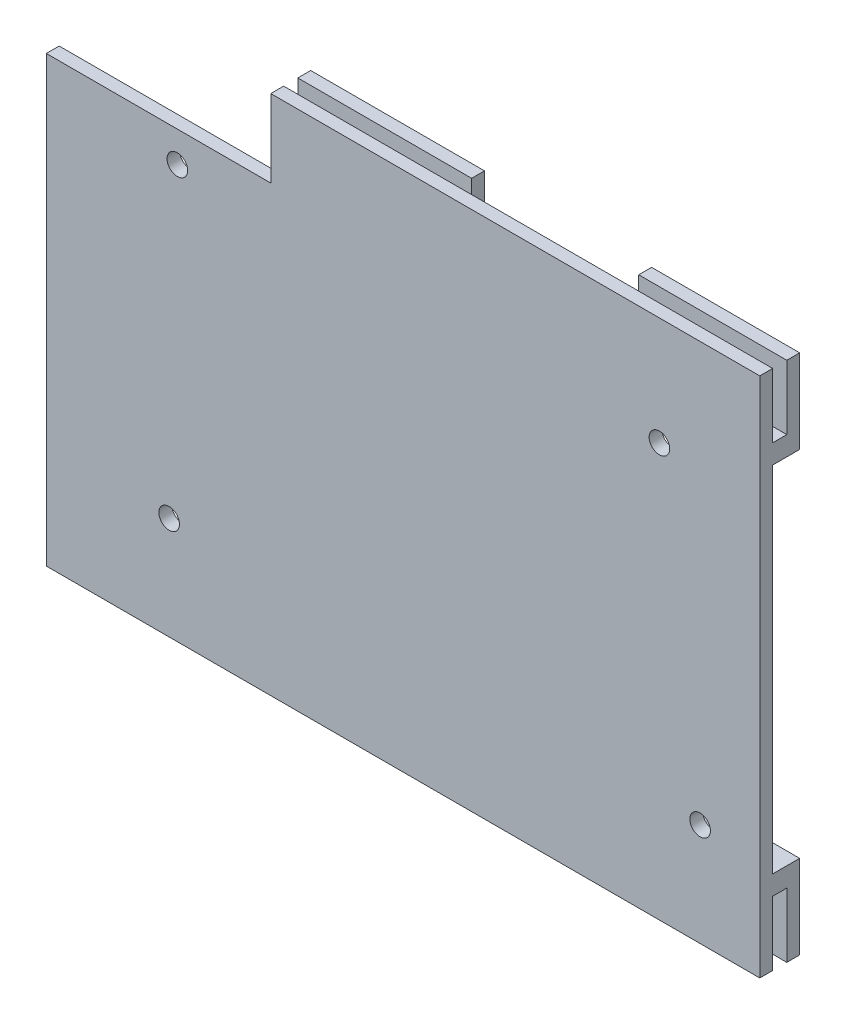
ISO-10303-21;
HEADER;
FILE_DESCRIPTION(('STEP AP214'),'2;1');
FILE_NAME('part.step','',(''),(''),'','','');
FILE_SCHEMA(('AUTOMOTIVE_DESIGN { 1 0 10303 214 1 1 1 1 }'));
ENDSEC;
DATA;
#1=APPLICATION_CONTEXT('core data for automotive mechanical design processes');
#2=APPLICATION_PROTOCOL_DEFINITION('international standard','automotive_design',2000,#1);
#3=PRODUCT_CONTEXT('',#1,'mechanical');
#4=PRODUCT('Part','Part','',(#3));
#5=PRODUCT_RELATED_PRODUCT_CATEGORY('part','',(#4));
#6=PRODUCT_DEFINITION_FORMATION('','',#4);
#7=PRODUCT_DEFINITION_CONTEXT('part definition',#1,'design');
#8=PRODUCT_DEFINITION('design','',#6,#7);
#9=PRODUCT_DEFINITION_SHAPE('','',#8);
#10=(LENGTH_UNIT() NAMED_UNIT(*) SI_UNIT(.MILLI.,.METRE.));
#11=(NAMED_UNIT(*) PLANE_ANGLE_UNIT() SI_UNIT($,.RADIAN.));
#12=(NAMED_UNIT(*) SI_UNIT($,.STERADIAN.) SOLID_ANGLE_UNIT());
#13=UNCERTAINTY_MEASURE_WITH_UNIT(LENGTH_MEASURE(1.E-05),#10,'distance_accuracy_value','');
#14=(GEOMETRIC_REPRESENTATION_CONTEXT(3) GLOBAL_UNCERTAINTY_ASSIGNED_CONTEXT((#13)) GLOBAL_UNIT_ASSIGNED_CONTEXT((#10,
#11,#12)) REPRESENTATION_CONTEXT('',''));
#15=CARTESIAN_POINT('',(0.,0.,0.));
#16=DIRECTION('',(0.,0.,1.));
#17=DIRECTION('',(1.,0.,0.));
#18=AXIS2_PLACEMENT_3D('',#15,#16,#17);
#19=CARTESIAN_POINT('',(55.,28.,-2.2));
#20=DIRECTION('',(0.,1.,0.));
#21=DIRECTION('',(0.,0.,1.));
#22=AXIS2_PLACEMENT_3D('',#19,#20,#21);
#23=PLANE('',#22);
#24=DIRECTION('',(-1.,0.,0.));
#25=VECTOR('',#24,1.);
#26=CARTESIAN_POINT('',(55.,28.,0.));
#27=LINE('',#26,#25);
#28=CARTESIAN_POINT('',(55.,28.,0.));
#29=VERTEX_POINT('',#28);
#30=CARTESIAN_POINT('',(32.,28.,0.));
#31=VERTEX_POINT('',#30);
#32=EDGE_CURVE('E304',#29,#31,#27,.T.);
#33=ORIENTED_EDGE('',*,*,#32,.T.);
#34=DIRECTION('',(0.,0.,-1.));
#35=VECTOR('',#34,1.);
#36=CARTESIAN_POINT('',(32.,28.,-2.2));
#37=LINE('',#36,#35);
#38=CARTESIAN_POINT('',(32.,28.,-4.2));
#39=VERTEX_POINT('',#38);
#40=EDGE_CURVE('E433',#31,#39,#37,.T.);
#41=ORIENTED_EDGE('',*,*,#40,.T.);
#42=DIRECTION('',(-1.,0.,0.));
#43=VECTOR('',#42,1.);
#44=CARTESIAN_POINT('',(55.,28.,-4.2));
#45=LINE('',#44,#43);
#46=CARTESIAN_POINT('',(55.,28.,-4.2));
#47=VERTEX_POINT('',#46);
#48=EDGE_CURVE('E364',#47,#39,#45,.T.);
#49=ORIENTED_EDGE('',*,*,#48,.F.);
#50=DIRECTION('',(0.,0.,1.));
#51=VECTOR('',#50,1.);
#52=CARTESIAN_POINT('',(55.,28.,-2.2));
#53=LINE('',#52,#51);
#54=EDGE_CURVE('E606',#47,#29,#53,.T.);
#55=ORIENTED_EDGE('',*,*,#54,.T.);
#56=EDGE_LOOP('',(#33,#41,#49,#55));
#57=FACE_BOUND('',#56,.T.);
#58=ADVANCED_FACE('F44',(#57),#23,.F.);
#59=CARTESIAN_POINT('',(55.,31.,-2.2));
#60=DIRECTION('',(0.,-1.,0.));
#61=DIRECTION('',(0.,0.,-1.));
#62=AXIS2_PLACEMENT_3D('',#59,#60,#61);
#63=PLANE('',#62);
#64=DIRECTION('',(1.,0.,0.));
#65=VECTOR('',#64,1.);
#66=CARTESIAN_POINT('',(55.,31.,-2.2));
#67=LINE('',#66,#65);
#68=CARTESIAN_POINT('',(32.,31.,-2.2));
#69=VERTEX_POINT('',#68);
#70=CARTESIAN_POINT('',(55.,31.,-2.2));
#71=VERTEX_POINT('',#70);
#72=EDGE_CURVE('E303',#69,#71,#67,.T.);
#73=ORIENTED_EDGE('',*,*,#72,.F.);
#74=DIRECTION('',(0.,0.,1.));
#75=VECTOR('',#74,1.);
#76=CARTESIAN_POINT('',(32.,31.,-2.2));
#77=LINE('',#76,#75);
#78=CARTESIAN_POINT('',(32.,31.,0.));
#79=VERTEX_POINT('',#78);
#80=EDGE_CURVE('E440',#69,#79,#77,.T.);
#81=ORIENTED_EDGE('',*,*,#80,.T.);
#82=DIRECTION('',(1.,0.,0.));
#83=VECTOR('',#82,1.);
#84=CARTESIAN_POINT('',(55.,31.,0.));
#85=LINE('',#84,#83);
#86=CARTESIAN_POINT('',(55.,31.,0.));
#87=VERTEX_POINT('',#86);
#88=EDGE_CURVE('E273',#79,#87,#85,.T.);
#89=ORIENTED_EDGE('',*,*,#88,.T.);
#90=DIRECTION('',(0.,0.,1.));
#91=VECTOR('',#90,1.);
#92=CARTESIAN_POINT('',(55.,31.,-2.2));
#93=LINE('',#92,#91);
#94=EDGE_CURVE('E322',#71,#87,#93,.T.);
#95=ORIENTED_EDGE('',*,*,#94,.F.);
#96=EDGE_LOOP('',(#73,#81,#89,#95));
#97=FACE_BOUND('',#96,.T.);
#98=ADVANCED_FACE('F613',(#97),#63,.F.);
#99=CARTESIAN_POINT('',(55.,-27.,-2.2));
#100=DIRECTION('',(0.,-1.,0.));
#101=DIRECTION('',(0.,0.,-1.));
#102=AXIS2_PLACEMENT_3D('',#99,#100,#101);
#103=PLANE('',#102);
#104=DIRECTION('',(1.,0.,0.));
#105=VECTOR('',#104,1.);
#106=CARTESIAN_POINT('',(55.,-27.,-4.2));
#107=LINE('',#106,#105);
#108=CARTESIAN_POINT('',(32.,-27.,-4.2));
#109=VERTEX_POINT('',#108);
#110=CARTESIAN_POINT('',(55.,-27.,-4.2));
#111=VERTEX_POINT('',#110);
#112=EDGE_CURVE('E377',#109,#111,#107,.T.);
#113=ORIENTED_EDGE('',*,*,#112,.F.);
#114=DIRECTION('',(0.,0.,1.));
#115=VECTOR('',#114,1.);
#116=CARTESIAN_POINT('',(32.,-27.,-2.2));
#117=LINE('',#116,#115);
#118=CARTESIAN_POINT('',(32.,-27.,0.));
#119=VERTEX_POINT('',#118);
#120=EDGE_CURVE('E436',#109,#119,#117,.T.);
#121=ORIENTED_EDGE('',*,*,#120,.T.);
#122=DIRECTION('',(1.,0.,0.));
#123=VECTOR('',#122,1.);
#124=CARTESIAN_POINT('',(55.,-27.,0.));
#125=LINE('',#124,#123);
#126=CARTESIAN_POINT('',(55.,-27.,0.));
#127=VERTEX_POINT('',#126);
#128=EDGE_CURVE('E332',#119,#127,#125,.T.);
#129=ORIENTED_EDGE('',*,*,#128,.T.);
#130=DIRECTION('',(0.,0.,1.));
#131=VECTOR('',#130,1.);
#132=CARTESIAN_POINT('',(55.,-27.,-2.2));
#133=LINE('',#132,#131);
#134=EDGE_CURVE('E340',#111,#127,#133,.T.);
#135=ORIENTED_EDGE('',*,*,#134,.F.);
#136=EDGE_LOOP('',(#113,#121,#129,#135));
#137=FACE_BOUND('',#136,.T.);
#138=ADVANCED_FACE('F524',(#137),#103,.F.);
#139=CARTESIAN_POINT('',(55.,-30.,-2.2));
#140=DIRECTION('',(0.,1.,0.));
#141=DIRECTION('',(0.,0.,1.));
#142=AXIS2_PLACEMENT_3D('',#139,#140,#141);
#143=PLANE('',#142);
#144=DIRECTION('',(-1.,0.,0.));
#145=VECTOR('',#144,1.);
#146=CARTESIAN_POINT('',(55.,-30.,0.));
#147=LINE('',#146,#145);
#148=CARTESIAN_POINT('',(55.,-30.,0.));
#149=VERTEX_POINT('',#148);
#150=CARTESIAN_POINT('',(32.,-30.,0.));
#151=VERTEX_POINT('',#150);
#152=EDGE_CURVE('E333',#149,#151,#147,.T.);
#153=ORIENTED_EDGE('',*,*,#152,.T.);
#154=DIRECTION('',(0.,0.,-1.));
#155=VECTOR('',#154,1.);
#156=CARTESIAN_POINT('',(32.,-30.,-2.2));
#157=LINE('',#156,#155);
#158=CARTESIAN_POINT('',(32.,-30.,-2.2));
#159=VERTEX_POINT('',#158);
#160=EDGE_CURVE('E447',#151,#159,#157,.T.);
#161=ORIENTED_EDGE('',*,*,#160,.T.);
#162=DIRECTION('',(-1.,0.,0.));
#163=VECTOR('',#162,1.);
#164=CARTESIAN_POINT('',(55.,-30.,-2.2));
#165=LINE('',#164,#163);
#166=CARTESIAN_POINT('',(55.,-30.,-2.2));
#167=VERTEX_POINT('',#166);
#168=EDGE_CURVE('E323',#167,#159,#165,.T.);
#169=ORIENTED_EDGE('',*,*,#168,.F.);
#170=DIRECTION('',(0.,0.,1.));
#171=VECTOR('',#170,1.);
#172=CARTESIAN_POINT('',(55.,-30.,-2.2));
#173=LINE('',#172,#171);
#174=EDGE_CURVE('E337',#167,#149,#173,.T.);
#175=ORIENTED_EDGE('',*,*,#174,.T.);
#176=EDGE_LOOP('',(#153,#161,#169,#175));
#177=FACE_BOUND('',#176,.T.);
#178=ADVANCED_FACE('F636',(#177),#143,.F.);
#179=CARTESIAN_POINT('',(0.,0.,-2.2));
#180=DIRECTION('',(0.,0.,1.));
#181=DIRECTION('',(1.,0.,0.));
#182=AXIS2_PLACEMENT_3D('',#179,#180,#181);
#183=PLANE('',#182);
#184=DIRECTION('',(0.,1.,0.));
#185=VECTOR('',#184,1.);
#186=CARTESIAN_POINT('',(32.,0.,-2.2));
#187=LINE('',#186,#185);
#188=CARTESIAN_POINT('',(32.,41.,-2.19999999999999));
#189=VERTEX_POINT('',#188);
#190=EDGE_CURVE('E444',#69,#189,#187,.T.);
#191=ORIENTED_EDGE('',*,*,#190,.F.);
#192=ORIENTED_EDGE('',*,*,#72,.T.);
#193=DIRECTION('',(0.,-1.,0.));
#194=VECTOR('',#193,1.);
#195=CARTESIAN_POINT('',(55.,28.,-2.2));
#196=LINE('',#195,#194);
#197=CARTESIAN_POINT('',(55.,41.,-2.2));
#198=VERTEX_POINT('',#197);
#199=EDGE_CURVE('E355',#198,#71,#196,.T.);
#200=ORIENTED_EDGE('',*,*,#199,.F.);
#201=DIRECTION('',(1.,0.,0.));
#202=VECTOR('',#201,1.);
#203=CARTESIAN_POINT('',(55.,41.,-2.2));
#204=LINE('',#203,#202);
#205=EDGE_CURVE('E354',#189,#198,#204,.T.);
#206=ORIENTED_EDGE('',*,*,#205,.F.);
#207=EDGE_LOOP('',(#191,#192,#200,#206));
#208=FACE_BOUND('',#207,.T.);
#209=ADVANCED_FACE('F721',(#208),#183,.T.);
#210=CARTESIAN_POINT('',(55.,41.,-4.2));
#211=DIRECTION('',(0.,-1.,0.));
#212=DIRECTION('',(0.,0.,-1.));
#213=AXIS2_PLACEMENT_3D('',#210,#211,#212);
#214=PLANE('',#213);
#215=DIRECTION('',(1.,0.,0.));
#216=VECTOR('',#215,1.);
#217=CARTESIAN_POINT('',(55.,41.,-4.2));
#218=LINE('',#217,#216);
#219=CARTESIAN_POINT('',(32.,41.,-4.2));
#220=VERTEX_POINT('',#219);
#221=CARTESIAN_POINT('',(55.,41.,-4.2));
#222=VERTEX_POINT('',#221);
#223=EDGE_CURVE('E363',#220,#222,#218,.T.);
#224=ORIENTED_EDGE('',*,*,#223,.F.);
#225=DIRECTION('',(0.,0.,-1.));
#226=VECTOR('',#225,1.);
#227=CARTESIAN_POINT('',(32.,41.,85.0583423304264));
#228=LINE('',#227,#226);
#229=EDGE_CURVE('E486',#189,#220,#228,.T.);
#230=ORIENTED_EDGE('',*,*,#229,.F.);
#231=ORIENTED_EDGE('',*,*,#205,.T.);
#232=DIRECTION('',(0.,0.,1.));
#233=VECTOR('',#232,1.);
#234=CARTESIAN_POINT('',(55.,41.,-4.2));
#235=LINE('',#234,#233);
#236=EDGE_CURVE('E344',#222,#198,#235,.T.);
#237=ORIENTED_EDGE('',*,*,#236,.F.);
#238=EDGE_LOOP('',(#224,#230,#231,#237));
#239=FACE_BOUND('',#238,.T.);
#240=ADVANCED_FACE('F733',(#239),#214,.F.);
#241=CARTESIAN_POINT('',(0.,0.,-4.2));
#242=DIRECTION('',(0.,0.,1.));
#243=DIRECTION('',(1.,0.,0.));
#244=AXIS2_PLACEMENT_3D('',#241,#242,#243);
#245=PLANE('',#244);
#246=ORIENTED_EDGE('',*,*,#48,.T.);
#247=DIRECTION('',(0.,-1.,0.));
#248=VECTOR('',#247,1.);
#249=CARTESIAN_POINT('',(32.,41.,-4.2));
#250=LINE('',#249,#248);
#251=EDGE_CURVE('E253',#220,#39,#250,.T.);
#252=ORIENTED_EDGE('',*,*,#251,.F.);
#253=ORIENTED_EDGE('',*,*,#223,.T.);
#254=DIRECTION('',(0.,-1.,0.));
#255=VECTOR('',#254,1.);
#256=CARTESIAN_POINT('',(55.,28.,-4.2));
#257=LINE('',#256,#255);
#258=EDGE_CURVE('E353',#222,#47,#257,.T.);
#259=ORIENTED_EDGE('',*,*,#258,.T.);
#260=EDGE_LOOP('',(#246,#252,#253,#259));
#261=FACE_BOUND('',#260,.T.);
#262=ADVANCED_FACE('F744',(#261),#245,.F.);
#263=CARTESIAN_POINT('',(0.,0.,-2.2));
#264=DIRECTION('',(0.,0.,1.));
#265=DIRECTION('',(1.,0.,0.));
#266=AXIS2_PLACEMENT_3D('',#263,#264,#265);
#267=PLANE('',#266);
#268=DIRECTION('',(0.,1.,0.));
#269=VECTOR('',#268,1.);
#270=CARTESIAN_POINT('',(32.,0.,-2.2));
#271=LINE('',#270,#269);
#272=CARTESIAN_POINT('',(32.,-40.,-2.19999999999999));
#273=VERTEX_POINT('',#272);
#274=EDGE_CURVE('E451',#273,#159,#271,.T.);
#275=ORIENTED_EDGE('',*,*,#274,.F.);
#276=DIRECTION('',(-1.,0.,0.));
#277=VECTOR('',#276,1.);
#278=CARTESIAN_POINT('',(55.,-40.,-2.2));
#279=LINE('',#278,#277);
#280=CARTESIAN_POINT('',(55.,-40.,-2.2));
#281=VERTEX_POINT('',#280);
#282=EDGE_CURVE('E387',#281,#273,#279,.T.);
#283=ORIENTED_EDGE('',*,*,#282,.F.);
#284=DIRECTION('',(0.,-1.,0.));
#285=VECTOR('',#284,1.);
#286=CARTESIAN_POINT('',(55.,-27.,-2.2));
#287=LINE('',#286,#285);
#288=EDGE_CURVE('E359',#167,#281,#287,.T.);
#289=ORIENTED_EDGE('',*,*,#288,.F.);
#290=ORIENTED_EDGE('',*,*,#168,.T.);
#291=EDGE_LOOP('',(#275,#283,#289,#290));
#292=FACE_BOUND('',#291,.T.);
#293=ADVANCED_FACE('F640',(#292),#267,.T.);
#294=CARTESIAN_POINT('',(55.,-40.,-4.2));
#295=DIRECTION('',(0.,1.,0.));
#296=DIRECTION('',(0.,0.,1.));
#297=AXIS2_PLACEMENT_3D('',#294,#295,#296);
#298=PLANE('',#297);
#299=ORIENTED_EDGE('',*,*,#282,.T.);
#300=DIRECTION('',(0.,0.,-1.));
#301=VECTOR('',#300,1.);
#302=CARTESIAN_POINT('',(32.,-40.,85.0583423304264));
#303=LINE('',#302,#301);
#304=CARTESIAN_POINT('',(32.,-40.,-4.2));
#305=VERTEX_POINT('',#304);
#306=EDGE_CURVE('E474',#273,#305,#303,.T.);
#307=ORIENTED_EDGE('',*,*,#306,.T.);
#308=DIRECTION('',(-1.,0.,0.));
#309=VECTOR('',#308,1.);
#310=CARTESIAN_POINT('',(55.,-40.,-4.2));
#311=LINE('',#310,#309);
#312=CARTESIAN_POINT('',(55.,-40.,-4.2));
#313=VERTEX_POINT('',#312);
#314=EDGE_CURVE('E381',#313,#305,#311,.T.);
#315=ORIENTED_EDGE('',*,*,#314,.F.);
#316=DIRECTION('',(0.,0.,1.));
#317=VECTOR('',#316,1.);
#318=CARTESIAN_POINT('',(55.,-40.,-4.2));
#319=LINE('',#318,#317);
#320=EDGE_CURVE('E391',#313,#281,#319,.T.);
#321=ORIENTED_EDGE('',*,*,#320,.T.);
#322=EDGE_LOOP('',(#299,#307,#315,#321));
#323=FACE_BOUND('',#322,.T.);
#324=ADVANCED_FACE('F642',(#323),#298,.F.);
#325=CARTESIAN_POINT('',(0.,0.,-4.2));
#326=DIRECTION('',(0.,0.,1.));
#327=DIRECTION('',(1.,0.,0.));
#328=AXIS2_PLACEMENT_3D('',#325,#326,#327);
#329=PLANE('',#328);
#330=ORIENTED_EDGE('',*,*,#314,.T.);
#331=DIRECTION('',(0.,1.,0.));
#332=VECTOR('',#331,1.);
#333=CARTESIAN_POINT('',(32.,0.,-4.2));
#334=LINE('',#333,#332);
#335=EDGE_CURVE('E53',#305,#109,#334,.T.);
#336=ORIENTED_EDGE('',*,*,#335,.T.);
#337=ORIENTED_EDGE('',*,*,#112,.T.);
#338=DIRECTION('',(0.,-1.,0.));
#339=VECTOR('',#338,1.);
#340=CARTESIAN_POINT('',(55.,-27.,-4.2));
#341=LINE('',#340,#339);
#342=EDGE_CURVE('E378',#111,#313,#341,.T.);
#343=ORIENTED_EDGE('',*,*,#342,.T.);
#344=EDGE_LOOP('',(#330,#336,#337,#343));
#345=FACE_BOUND('',#344,.T.);
#346=ADVANCED_FACE('F644',(#345),#329,.F.);
#347=CARTESIAN_POINT('',(6.04,28.,-4.2));
#348=VERTEX_POINT('',#347);
#349=CARTESIAN_POINT('',(-20.96,28.,-4.2));
#350=VERTEX_POINT('',#349);
#351=EDGE_CURVE('E368',#348,#350,#45,.T.);
#352=ORIENTED_EDGE('',*,*,#351,.F.);
#353=DIRECTION('',(0.,0.,1.));
#354=VECTOR('',#353,1.);
#355=CARTESIAN_POINT('',(6.04,28.,-2.2));
#356=LINE('',#355,#354);
#357=CARTESIAN_POINT('',(6.03999999999999,28.,0.));
#358=VERTEX_POINT('',#357);
#359=EDGE_CURVE('E67',#348,#358,#356,.T.);
#360=ORIENTED_EDGE('',*,*,#359,.T.);
#361=CARTESIAN_POINT('',(-20.96,28.,0.));
#362=VERTEX_POINT('',#361);
#363=EDGE_CURVE('E312',#358,#362,#27,.T.);
#364=ORIENTED_EDGE('',*,*,#363,.T.);
#365=DIRECTION('',(0.,0.,-1.));
#366=VECTOR('',#365,1.);
#367=CARTESIAN_POINT('',(-20.96,28.,-2.2));
#368=LINE('',#367,#366);
#369=EDGE_CURVE('E395',#362,#350,#368,.T.);
#370=ORIENTED_EDGE('',*,*,#369,.T.);
#371=EDGE_LOOP('',(#352,#360,#364,#370));
#372=FACE_BOUND('',#371,.T.);
#373=ADVANCED_FACE('F646',(#372),#23,.F.);
#374=CARTESIAN_POINT('',(-20.9574410194763,31.,0.));
#375=VERTEX_POINT('',#374);
#376=CARTESIAN_POINT('',(6.03999999999999,31.,0.));
#377=VERTEX_POINT('',#376);
#378=EDGE_CURVE('E288',#375,#377,#85,.T.);
#379=ORIENTED_EDGE('',*,*,#378,.T.);
#380=DIRECTION('',(0.,0.,-1.));
#381=VECTOR('',#380,1.);
#382=CARTESIAN_POINT('',(6.03999999999999,31.,-2.2));
#383=LINE('',#382,#381);
#384=CARTESIAN_POINT('',(6.03999999999999,31.,-2.2));
#385=VERTEX_POINT('',#384);
#386=EDGE_CURVE('E460',#377,#385,#383,.T.);
#387=ORIENTED_EDGE('',*,*,#386,.T.);
#388=CARTESIAN_POINT('',(-20.96,31.,-2.2));
#389=VERTEX_POINT('',#388);
#390=EDGE_CURVE('E309',#389,#385,#67,.T.);
#391=ORIENTED_EDGE('',*,*,#390,.F.);
#392=DIRECTION('',(0.,0.,-1.));
#393=VECTOR('',#392,1.);
#394=CARTESIAN_POINT('',(-20.96,31.,-2.2));
#395=LINE('',#394,#393);
#396=CARTESIAN_POINT('',(-20.96,31.,0.));
#397=VERTEX_POINT('',#396);
#398=EDGE_CURVE('E420',#397,#389,#395,.T.);
#399=ORIENTED_EDGE('',*,*,#398,.F.);
#400=EDGE_CURVE('E295',#397,#375,#85,.T.);
#401=ORIENTED_EDGE('',*,*,#400,.T.);
#402=EDGE_LOOP('',(#379,#387,#391,#399,#401));
#403=FACE_BOUND('',#402,.T.);
#404=ADVANCED_FACE('F653',(#403),#63,.F.);
#405=CARTESIAN_POINT('',(0.,0.,0.));
#406=DIRECTION('',(0.,0.,1.));
#407=DIRECTION('',(1.,0.,0.));
#408=AXIS2_PLACEMENT_3D('',#405,#406,#407);
#409=PLANE('',#408);
#410=ORIENTED_EDGE('',*,*,#400,.F.);
#411=DIRECTION('',(0.,-1.,0.));
#412=VECTOR('',#411,1.);
#413=CARTESIAN_POINT('',(-20.96,41.,0.));
#414=LINE('',#413,#412);
#415=CARTESIAN_POINT('',(-20.96,28.963654442647,0.));
#416=VERTEX_POINT('',#415);
#417=EDGE_CURVE('E427',#397,#416,#414,.T.);
#418=ORIENTED_EDGE('',*,*,#417,.T.);
#419=DIRECTION('',(1.,0.,0.));
#420=VECTOR('',#419,1.);
#421=CARTESIAN_POINT('',(-55.,28.963654442647,0.));
#422=LINE('',#421,#420);
#423=CARTESIAN_POINT('',(-20.9574410194763,28.963654442647,0.));
#424=VERTEX_POINT('',#423);
#425=EDGE_CURVE('E582',#416,#424,#422,.T.);
#426=ORIENTED_EDGE('',*,*,#425,.T.);
#427=DIRECTION('',(0.,1.,0.));
#428=VECTOR('',#427,1.);
#429=CARTESIAN_POINT('',(-20.9574410194763,40.,0.));
#430=LINE('',#429,#428);
#431=EDGE_CURVE('E578',#424,#375,#430,.T.);
#432=ORIENTED_EDGE('',*,*,#431,.T.);
#433=EDGE_LOOP('',(#410,#418,#426,#432));
#434=FACE_BOUND('',#433,.T.);
#435=ADVANCED_FACE('F1030',(#434),#409,.T.);
#436=CARTESIAN_POINT('',(-20.96,-27.,0.));
#437=VERTEX_POINT('',#436);
#438=CARTESIAN_POINT('',(6.03999999999999,-27.,0.));
#439=VERTEX_POINT('',#438);
#440=EDGE_CURVE('E318',#437,#439,#125,.T.);
#441=ORIENTED_EDGE('',*,*,#440,.T.);
#442=DIRECTION('',(0.,0.,-1.));
#443=VECTOR('',#442,1.);
#444=CARTESIAN_POINT('',(6.04,-27.,-2.2));
#445=LINE('',#444,#443);
#446=CARTESIAN_POINT('',(6.03999999999999,-27.,-4.2));
#447=VERTEX_POINT('',#446);
#448=EDGE_CURVE('E456',#439,#447,#445,.T.);
#449=ORIENTED_EDGE('',*,*,#448,.T.);
#450=CARTESIAN_POINT('',(-20.96,-27.,-4.2));
#451=VERTEX_POINT('',#450);
#452=EDGE_CURVE('E372',#451,#447,#107,.T.);
#453=ORIENTED_EDGE('',*,*,#452,.F.);
#454=DIRECTION('',(0.,0.,1.));
#455=VECTOR('',#454,1.);
#456=CARTESIAN_POINT('',(-20.96,-27.,-2.2));
#457=LINE('',#456,#455);
#458=EDGE_CURVE('E399',#451,#437,#457,.T.);
#459=ORIENTED_EDGE('',*,*,#458,.T.);
#460=EDGE_LOOP('',(#441,#449,#453,#459));
#461=FACE_BOUND('',#460,.T.);
#462=ADVANCED_FACE('F844',(#461),#103,.F.);
#463=CARTESIAN_POINT('',(6.03999999999999,-30.,-2.2));
#464=VERTEX_POINT('',#463);
#465=CARTESIAN_POINT('',(-20.96,-30.,-2.2));
#466=VERTEX_POINT('',#465);
#467=EDGE_CURVE('E328',#464,#466,#165,.T.);
#468=ORIENTED_EDGE('',*,*,#467,.F.);
#469=DIRECTION('',(0.,0.,1.));
#470=VECTOR('',#469,1.);
#471=CARTESIAN_POINT('',(6.03999999999999,-30.,-2.2));
#472=LINE('',#471,#470);
#473=CARTESIAN_POINT('',(6.03999999999999,-30.,0.));
#474=VERTEX_POINT('',#473);
#475=EDGE_CURVE('E466',#464,#474,#472,.T.);
#476=ORIENTED_EDGE('',*,*,#475,.T.);
#477=CARTESIAN_POINT('',(-20.96,-30.,0.));
#478=VERTEX_POINT('',#477);
#479=EDGE_CURVE('E327',#474,#478,#147,.T.);
#480=ORIENTED_EDGE('',*,*,#479,.T.);
#481=DIRECTION('',(0.,0.,1.));
#482=VECTOR('',#481,1.);
#483=CARTESIAN_POINT('',(-20.96,-30.,-2.2));
#484=LINE('',#483,#482);
#485=EDGE_CURVE('E423',#466,#478,#484,.T.);
#486=ORIENTED_EDGE('',*,*,#485,.F.);
#487=EDGE_LOOP('',(#468,#476,#480,#486));
#488=FACE_BOUND('',#487,.T.);
#489=ADVANCED_FACE('F698',(#488),#143,.F.);
#490=CARTESIAN_POINT('',(0.,0.,0.));
#491=DIRECTION('',(0.,0.,-1.));
#492=DIRECTION('',(-1.,0.,0.));
#493=AXIS2_PLACEMENT_3D('',#490,#491,#492);
#494=PLANE('',#493);
#495=DIRECTION('',(0.,-1.,0.));
#496=VECTOR('',#495,1.);
#497=CARTESIAN_POINT('',(-55.8235429728034,97.9273088852941,0.));
#498=LINE('',#497,#496);
#499=CARTESIAN_POINT('',(-55.8235429728034,28.963654442647,0.));
#500=VERTEX_POINT('',#499);
#501=CARTESIAN_POINT('',(-55.8235429728034,-40.,0.));
#502=VERTEX_POINT('',#501);
#503=EDGE_CURVE('E248',#500,#502,#498,.T.);
#504=ORIENTED_EDGE('',*,*,#503,.F.);
#505=EDGE_CURVE('E590',#500,#416,#422,.T.);
#506=ORIENTED_EDGE('',*,*,#505,.T.);
#507=EDGE_CURVE('E432',#416,#362,#414,.T.);
#508=ORIENTED_EDGE('',*,*,#507,.T.);
#509=ORIENTED_EDGE('',*,*,#363,.F.);
#510=DIRECTION('',(0.,-1.,0.));
#511=VECTOR('',#510,1.);
#512=CARTESIAN_POINT('',(6.03999999999999,41.,0.));
#513=LINE('',#512,#511);
#514=EDGE_CURVE('E498',#377,#358,#513,.T.);
#515=ORIENTED_EDGE('',*,*,#514,.F.);
#516=ORIENTED_EDGE('',*,*,#378,.F.);
#517=CARTESIAN_POINT('',(-20.9574410194763,41.,0.));
#518=VERTEX_POINT('',#517);
#519=EDGE_CURVE('E589',#375,#518,#430,.T.);
#520=ORIENTED_EDGE('',*,*,#519,.T.);
#521=DIRECTION('',(-1.,0.,0.));
#522=VECTOR('',#521,1.);
#523=CARTESIAN_POINT('',(-20.9574410194763,41.,0.));
#524=LINE('',#523,#522);
#525=CARTESIAN_POINT('',(55.,41.,0.));
#526=VERTEX_POINT('',#525);
#527=EDGE_CURVE('E585',#526,#518,#524,.T.);
#528=ORIENTED_EDGE('',*,*,#527,.F.);
#529=DIRECTION('',(0.,1.,0.));
#530=VECTOR('',#529,1.);
#531=CARTESIAN_POINT('',(55.,-40.,0.));
#532=LINE('',#531,#530);
#533=EDGE_CURVE('E284',#87,#526,#532,.T.);
#534=ORIENTED_EDGE('',*,*,#533,.F.);
#535=ORIENTED_EDGE('',*,*,#88,.F.);
#536=DIRECTION('',(0.,1.,0.));
#537=VECTOR('',#536,1.);
#538=CARTESIAN_POINT('',(32.,41.,0.));
#539=LINE('',#538,#537);
#540=EDGE_CURVE('E495',#31,#79,#539,.T.);
#541=ORIENTED_EDGE('',*,*,#540,.F.);
#542=ORIENTED_EDGE('',*,*,#32,.F.);
#543=EDGE_CURVE('E283',#127,#29,#532,.T.);
#544=ORIENTED_EDGE('',*,*,#543,.F.);
#545=ORIENTED_EDGE('',*,*,#128,.F.);
#546=EDGE_CURVE('E473',#151,#119,#539,.T.);
#547=ORIENTED_EDGE('',*,*,#546,.F.);
#548=ORIENTED_EDGE('',*,*,#152,.F.);
#549=CARTESIAN_POINT('',(55.,-40.,0.));
#550=VERTEX_POINT('',#549);
#551=EDGE_CURVE('E279',#550,#149,#532,.T.);
#552=ORIENTED_EDGE('',*,*,#551,.F.);
#553=DIRECTION('',(1.,0.,0.));
#554=VECTOR('',#553,1.);
#555=CARTESIAN_POINT('',(-55.,-40.,0.));
#556=LINE('',#555,#554);
#557=EDGE_CURVE('E275',#502,#550,#556,.T.);
#558=ORIENTED_EDGE('',*,*,#557,.F.);
#559=EDGE_LOOP('',(#504,#506,#508,#509,#515,#516,#520,#528,#534,#535,#541,#542,#544,#545,#547,
#548,#552,#558));
#560=FACE_BOUND('',#559,.T.);
#561=ORIENTED_EDGE('',*,*,#479,.F.);
#562=EDGE_CURVE('E489',#439,#474,#513,.T.);
#563=ORIENTED_EDGE('',*,*,#562,.F.);
#564=ORIENTED_EDGE('',*,*,#440,.F.);
#565=EDGE_CURVE('E428',#437,#478,#414,.T.);
#566=ORIENTED_EDGE('',*,*,#565,.T.);
#567=EDGE_LOOP('',(#561,#563,#564,#566));
#568=FACE_BOUND('',#567,.T.);
#569=CARTESIAN_POINT('',(-36.7409523113356,-24.0404431673531,0.));
#570=DIRECTION('',(0.,0.,-1.));
#571=DIRECTION('',(-1.,0.,0.));
#572=AXIS2_PLACEMENT_3D('',#569,#570,#571);
#573=CIRCLE('',#572,1.6);
#574=CARTESIAN_POINT('',(-38.3409523113356,-24.0404431673531,0.));
#575=VERTEX_POINT('',#574);
#576=EDGE_CURVE('E555',#575,#575,#573,.T.);
#577=ORIENTED_EDGE('',*,*,#576,.F.);
#578=EDGE_LOOP('',(#577));
#579=FACE_BOUND('',#578,.T.);
#580=CARTESIAN_POINT('',(-35.4709523113356,24.1815568326469,0.));
#581=DIRECTION('',(0.,0.,-1.));
#582=DIRECTION('',(-1.,0.,0.));
#583=AXIS2_PLACEMENT_3D('',#580,#581,#582);
#584=CIRCLE('',#583,1.6);
#585=CARTESIAN_POINT('',(-37.0709523113356,24.1815568326469,0.));
#586=VERTEX_POINT('',#585);
#587=EDGE_CURVE('E543',#586,#586,#584,.T.);
#588=ORIENTED_EDGE('',*,*,#587,.F.);
#589=EDGE_LOOP('',(#588));
#590=FACE_BOUND('',#589,.T.);
#591=CARTESIAN_POINT('',(45.7380476886644,-24.0404431673531,0.));
#592=DIRECTION('',(0.,0.,-1.));
#593=DIRECTION('',(-1.,0.,0.));
#594=AXIS2_PLACEMENT_3D('',#591,#592,#593);
#595=CIRCLE('',#594,1.6);
#596=CARTESIAN_POINT('',(44.1380476886644,-24.0404431673531,0.));
#597=VERTEX_POINT('',#596);
#598=EDGE_CURVE('E564',#597,#597,#595,.T.);
#599=ORIENTED_EDGE('',*,*,#598,.F.);
#600=EDGE_LOOP('',(#599));
#601=FACE_BOUND('',#600,.T.);
#602=CARTESIAN_POINT('',(39.4110476886644,24.1815568326469,0.));
#603=DIRECTION('',(0.,0.,-1.));
#604=DIRECTION('',(-1.,0.,0.));
#605=AXIS2_PLACEMENT_3D('',#602,#603,#604);
#606=CIRCLE('',#605,1.6);
#607=CARTESIAN_POINT('',(37.8110476886644,24.1815568326469,0.));
#608=VERTEX_POINT('',#607);
#609=EDGE_CURVE('E549',#608,#608,#606,.T.);
#610=ORIENTED_EDGE('',*,*,#609,.F.);
#611=EDGE_LOOP('',(#610));
#612=FACE_BOUND('',#611,.T.);
#613=ADVANCED_FACE('F531',(#560,#568,#579,#590,#601,#612),#494,.T.);
#614=CARTESIAN_POINT('',(55.,-40.,2.));
#615=DIRECTION('',(-1.,0.,0.));
#616=DIRECTION('',(0.,0.,1.));
#617=AXIS2_PLACEMENT_3D('',#614,#615,#616);
#618=PLANE('',#617);
#619=ORIENTED_EDGE('',*,*,#551,.T.);
#620=ORIENTED_EDGE('',*,*,#174,.F.);
#621=ORIENTED_EDGE('',*,*,#288,.T.);
#622=ORIENTED_EDGE('',*,*,#320,.F.);
#623=ORIENTED_EDGE('',*,*,#342,.F.);
#624=ORIENTED_EDGE('',*,*,#134,.T.);
#625=ORIENTED_EDGE('',*,*,#543,.T.);
#626=ORIENTED_EDGE('',*,*,#54,.F.);
#627=ORIENTED_EDGE('',*,*,#258,.F.);
#628=ORIENTED_EDGE('',*,*,#236,.T.);
#629=ORIENTED_EDGE('',*,*,#199,.T.);
#630=ORIENTED_EDGE('',*,*,#94,.T.);
#631=ORIENTED_EDGE('',*,*,#533,.T.);
#632=DIRECTION('',(0.,0.,-1.));
#633=VECTOR('',#632,1.);
#634=CARTESIAN_POINT('',(55.,41.,2.));
#635=LINE('',#634,#633);
#636=CARTESIAN_POINT('',(55.,41.,2.));
#637=VERTEX_POINT('',#636);
#638=EDGE_CURVE('E595',#637,#526,#635,.T.);
#639=ORIENTED_EDGE('',*,*,#638,.F.);
#640=DIRECTION('',(0.,1.,0.));
#641=VECTOR('',#640,1.);
#642=CARTESIAN_POINT('',(55.,-40.,2.));
#643=LINE('',#642,#641);
#644=CARTESIAN_POINT('',(55.,-40.,2.));
#645=VERTEX_POINT('',#644);
#646=EDGE_CURVE('E269',#645,#637,#643,.T.);
#647=ORIENTED_EDGE('',*,*,#646,.F.);
#648=DIRECTION('',(0.,0.,-1.));
#649=VECTOR('',#648,1.);
#650=CARTESIAN_POINT('',(55.,-40.,2.));
#651=LINE('',#650,#649);
#652=EDGE_CURVE('E266',#645,#550,#651,.T.);
#653=ORIENTED_EDGE('',*,*,#652,.T.);
#654=EDGE_LOOP('',(#619,#620,#621,#622,#623,#624,#625,#626,#627,#628,#629,#630,#631,#639,#647,#653));
#655=FACE_BOUND('',#654,.T.);
#656=ADVANCED_FACE('F46',(#655),#618,.F.);
#657=CARTESIAN_POINT('',(-55.,-40.,2.));
#658=DIRECTION('',(0.,1.,0.));
#659=DIRECTION('',(0.,0.,1.));
#660=AXIS2_PLACEMENT_3D('',#657,#658,#659);
#661=PLANE('',#660);
#662=DIRECTION('',(1.,0.,0.));
#663=VECTOR('',#662,1.);
#664=CARTESIAN_POINT('',(-55.,-40.,2.));
#665=LINE('',#664,#663);
#666=CARTESIAN_POINT('',(-55.8235429728034,-40.,2.));
#667=VERTEX_POINT('',#666);
#668=EDGE_CURVE('E258',#667,#645,#665,.T.);
#669=ORIENTED_EDGE('',*,*,#668,.F.);
#670=DIRECTION('',(0.,0.,-1.));
#671=VECTOR('',#670,1.);
#672=CARTESIAN_POINT('',(-55.8235429728034,-40.,2.));
#673=LINE('',#672,#671);
#674=EDGE_CURVE('E245',#667,#502,#673,.T.);
#675=ORIENTED_EDGE('',*,*,#674,.T.);
#676=ORIENTED_EDGE('',*,*,#557,.T.);
#677=ORIENTED_EDGE('',*,*,#652,.F.);
#678=EDGE_LOOP('',(#669,#675,#676,#677));
#679=FACE_BOUND('',#678,.T.);
#680=ADVANCED_FACE('F264',(#679),#661,.F.);
#681=CARTESIAN_POINT('',(0.,0.,2.));
#682=DIRECTION('',(0.,0.,-1.));
#683=DIRECTION('',(-1.,0.,0.));
#684=AXIS2_PLACEMENT_3D('',#681,#682,#683);
#685=PLANE('',#684);
#686=CARTESIAN_POINT('',(-36.7409523113356,-24.0404431673531,2.));
#687=DIRECTION('',(0.,0.,-1.));
#688=DIRECTION('',(-1.,0.,0.));
#689=AXIS2_PLACEMENT_3D('',#686,#687,#688);
#690=CIRCLE('',#689,1.6);
#691=CARTESIAN_POINT('',(-38.3409523113356,-24.0404431673531,2.));
#692=VERTEX_POINT('',#691);
#693=EDGE_CURVE('E551',#692,#692,#690,.T.);
#694=ORIENTED_EDGE('',*,*,#693,.T.);
#695=EDGE_LOOP('',(#694));
#696=FACE_BOUND('',#695,.T.);
#697=CARTESIAN_POINT('',(45.7380476886644,-24.0404431673531,2.));
#698=DIRECTION('',(0.,0.,-1.));
#699=DIRECTION('',(-1.,0.,0.));
#700=AXIS2_PLACEMENT_3D('',#697,#698,#699);
#701=CIRCLE('',#700,1.6);
#702=CARTESIAN_POINT('',(44.1380476886644,-24.0404431673531,2.));
#703=VERTEX_POINT('',#702);
#704=EDGE_CURVE('E560',#703,#703,#701,.T.);
#705=ORIENTED_EDGE('',*,*,#704,.T.);
#706=EDGE_LOOP('',(#705));
#707=FACE_BOUND('',#706,.T.);
#708=CARTESIAN_POINT('',(39.4110476886644,24.1815568326469,2.));
#709=DIRECTION('',(0.,0.,-1.));
#710=DIRECTION('',(-1.,0.,0.));
#711=AXIS2_PLACEMENT_3D('',#708,#709,#710);
#712=CIRCLE('',#711,1.6);
#713=CARTESIAN_POINT('',(37.8110476886644,24.1815568326469,2.));
#714=VERTEX_POINT('',#713);
#715=EDGE_CURVE('E568',#714,#714,#712,.T.);
#716=ORIENTED_EDGE('',*,*,#715,.T.);
#717=EDGE_LOOP('',(#716));
#718=FACE_BOUND('',#717,.T.);
#719=CARTESIAN_POINT('',(-35.4709523113356,24.1815568326469,2.));
#720=DIRECTION('',(0.,0.,-1.));
#721=DIRECTION('',(-1.,0.,0.));
#722=AXIS2_PLACEMENT_3D('',#719,#720,#721);
#723=CIRCLE('',#722,1.6);
#724=CARTESIAN_POINT('',(-37.0709523113356,24.1815568326469,2.));
#725=VERTEX_POINT('',#724);
#726=EDGE_CURVE('E536',#725,#725,#723,.T.);
#727=ORIENTED_EDGE('',*,*,#726,.T.);
#728=EDGE_LOOP('',(#727));
#729=FACE_BOUND('',#728,.T.);
#730=DIRECTION('',(1.,0.,0.));
#731=VECTOR('',#730,1.);
#732=CARTESIAN_POINT('',(-55.,28.963654442647,2.));
#733=LINE('',#732,#731);
#734=CARTESIAN_POINT('',(-55.8235429728034,28.963654442647,2.));
#735=VERTEX_POINT('',#734);
#736=CARTESIAN_POINT('',(-20.9574410194763,28.963654442647,2.));
#737=VERTEX_POINT('',#736);
#738=EDGE_CURVE('E261',#735,#737,#733,.T.);
#739=ORIENTED_EDGE('',*,*,#738,.F.);
#740=DIRECTION('',(0.,-1.,0.));
#741=VECTOR('',#740,1.);
#742=CARTESIAN_POINT('',(-55.8235429728034,97.9273088852941,2.));
#743=LINE('',#742,#741);
#744=EDGE_CURVE('E60',#735,#667,#743,.T.);
#745=ORIENTED_EDGE('',*,*,#744,.T.);
#746=ORIENTED_EDGE('',*,*,#668,.T.);
#747=ORIENTED_EDGE('',*,*,#646,.T.);
#748=DIRECTION('',(1.,0.,0.));
#749=VECTOR('',#748,1.);
#750=CARTESIAN_POINT('',(-20.9574410194763,41.,2.));
#751=LINE('',#750,#749);
#752=CARTESIAN_POINT('',(-20.9574410194763,41.,2.));
#753=VERTEX_POINT('',#752);
#754=EDGE_CURVE('E598',#753,#637,#751,.T.);
#755=ORIENTED_EDGE('',*,*,#754,.F.);
#756=DIRECTION('',(0.,1.,0.));
#757=VECTOR('',#756,1.);
#758=CARTESIAN_POINT('',(-20.9574410194763,40.,2.));
#759=LINE('',#758,#757);
#760=EDGE_CURVE('E579',#737,#753,#759,.T.);
#761=ORIENTED_EDGE('',*,*,#760,.F.);
#762=EDGE_LOOP('',(#739,#745,#746,#747,#755,#761));
#763=FACE_BOUND('',#762,.T.);
#764=ADVANCED_FACE('F257',(#696,#707,#718,#729,#763),#685,.F.);
#765=CARTESIAN_POINT('',(-35.4709523113356,24.1815568326469,2.));
#766=DIRECTION('',(0.,0.,-1.));
#767=DIRECTION('',(-1.,0.,0.));
#768=AXIS2_PLACEMENT_3D('',#765,#766,#767);
#769=CYLINDRICAL_SURFACE('',#768,1.6);
#770=ORIENTED_EDGE('',*,*,#726,.F.);
#771=EDGE_LOOP('',(#770));
#772=FACE_BOUND('',#771,.T.);
#773=ORIENTED_EDGE('',*,*,#587,.T.);
#774=EDGE_LOOP('',(#773));
#775=FACE_BOUND('',#774,.T.);
#776=ADVANCED_FACE('F683',(#772,#775),#769,.F.);
#777=CARTESIAN_POINT('',(39.4110476886644,24.1815568326469,2.));
#778=DIRECTION('',(0.,0.,-1.));
#779=DIRECTION('',(-1.,0.,0.));
#780=AXIS2_PLACEMENT_3D('',#777,#778,#779);
#781=CYLINDRICAL_SURFACE('',#780,1.6);
#782=ORIENTED_EDGE('',*,*,#715,.F.);
#783=EDGE_LOOP('',(#782));
#784=FACE_BOUND('',#783,.T.);
#785=ORIENTED_EDGE('',*,*,#609,.T.);
#786=EDGE_LOOP('',(#785));
#787=FACE_BOUND('',#786,.T.);
#788=ADVANCED_FACE('F679',(#784,#787),#781,.F.);
#789=CARTESIAN_POINT('',(45.7380476886644,-24.0404431673531,2.));
#790=DIRECTION('',(0.,0.,-1.));
#791=DIRECTION('',(-1.,0.,0.));
#792=AXIS2_PLACEMENT_3D('',#789,#790,#791);
#793=CYLINDRICAL_SURFACE('',#792,1.6);
#794=ORIENTED_EDGE('',*,*,#704,.F.);
#795=EDGE_LOOP('',(#794));
#796=FACE_BOUND('',#795,.T.);
#797=ORIENTED_EDGE('',*,*,#598,.T.);
#798=EDGE_LOOP('',(#797));
#799=FACE_BOUND('',#798,.T.);
#800=ADVANCED_FACE('F682',(#796,#799),#793,.F.);
#801=CARTESIAN_POINT('',(-36.7409523113356,-24.0404431673531,2.));
#802=DIRECTION('',(0.,0.,-1.));
#803=DIRECTION('',(-1.,0.,0.));
#804=AXIS2_PLACEMENT_3D('',#801,#802,#803);
#805=CYLINDRICAL_SURFACE('',#804,1.6);
#806=ORIENTED_EDGE('',*,*,#693,.F.);
#807=EDGE_LOOP('',(#806));
#808=FACE_BOUND('',#807,.T.);
#809=ORIENTED_EDGE('',*,*,#576,.T.);
#810=EDGE_LOOP('',(#809));
#811=FACE_BOUND('',#810,.T.);
#812=ADVANCED_FACE('F676',(#808,#811),#805,.F.);
#813=CARTESIAN_POINT('',(-20.9574410194763,40.,0.));
#814=DIRECTION('',(1.,0.,0.));
#815=DIRECTION('',(0.,0.,-1.));
#816=AXIS2_PLACEMENT_3D('',#813,#814,#815);
#817=PLANE('',#816);
#818=ORIENTED_EDGE('',*,*,#760,.T.);
#819=DIRECTION('',(0.,0.,1.));
#820=VECTOR('',#819,1.);
#821=CARTESIAN_POINT('',(-20.9574410194763,41.,2.));
#822=LINE('',#821,#820);
#823=EDGE_CURVE('E602',#518,#753,#822,.T.);
#824=ORIENTED_EDGE('',*,*,#823,.F.);
#825=ORIENTED_EDGE('',*,*,#519,.F.);
#826=ORIENTED_EDGE('',*,*,#431,.F.);
#827=DIRECTION('',(0.,0.,1.));
#828=VECTOR('',#827,1.);
#829=CARTESIAN_POINT('',(-20.9574410194763,28.963654442647,0.));
#830=LINE('',#829,#828);
#831=EDGE_CURVE('E556',#424,#737,#830,.T.);
#832=ORIENTED_EDGE('',*,*,#831,.T.);
#833=EDGE_LOOP('',(#818,#824,#825,#826,#832));
#834=FACE_BOUND('',#833,.T.);
#835=ADVANCED_FACE('F624',(#834),#817,.F.);
#836=CARTESIAN_POINT('',(-55.,28.963654442647,0.));
#837=DIRECTION('',(0.,-1.,0.));
#838=DIRECTION('',(0.,0.,-1.));
#839=AXIS2_PLACEMENT_3D('',#836,#837,#838);
#840=PLANE('',#839);
#841=ORIENTED_EDGE('',*,*,#505,.F.);
#842=DIRECTION('',(0.,0.,1.));
#843=VECTOR('',#842,1.);
#844=CARTESIAN_POINT('',(-55.8235429728034,28.963654442647,0.));
#845=LINE('',#844,#843);
#846=EDGE_CURVE('E12',#500,#735,#845,.T.);
#847=ORIENTED_EDGE('',*,*,#846,.T.);
#848=ORIENTED_EDGE('',*,*,#738,.T.);
#849=ORIENTED_EDGE('',*,*,#831,.F.);
#850=ORIENTED_EDGE('',*,*,#425,.F.);
#851=EDGE_LOOP('',(#841,#847,#848,#849,#850));
#852=FACE_BOUND('',#851,.T.);
#853=ADVANCED_FACE('F630',(#852),#840,.F.);
#854=CARTESIAN_POINT('',(0.,41.,0.));
#855=DIRECTION('',(0.,-1.,0.));
#856=DIRECTION('',(0.,0.,-1.));
#857=AXIS2_PLACEMENT_3D('',#854,#855,#856);
#858=PLANE('',#857);
#859=ORIENTED_EDGE('',*,*,#823,.T.);
#860=ORIENTED_EDGE('',*,*,#754,.T.);
#861=ORIENTED_EDGE('',*,*,#638,.T.);
#862=ORIENTED_EDGE('',*,*,#527,.T.);
#863=EDGE_LOOP('',(#859,#860,#861,#862));
#864=FACE_BOUND('',#863,.T.);
#865=ADVANCED_FACE('F620',(#864),#858,.F.);
#866=DIRECTION('',(0.,-1.,0.));
#867=VECTOR('',#866,1.);
#868=CARTESIAN_POINT('',(6.03999999999999,0.,-2.2));
#869=LINE('',#868,#867);
#870=CARTESIAN_POINT('',(6.03999999999999,41.,-2.19999999999999));
#871=VERTEX_POINT('',#870);
#872=EDGE_CURVE('E463',#871,#385,#869,.T.);
#873=ORIENTED_EDGE('',*,*,#872,.F.);
#874=CARTESIAN_POINT('',(-20.96,41.,-2.2));
#875=VERTEX_POINT('',#874);
#876=EDGE_CURVE('E349',#875,#871,#204,.T.);
#877=ORIENTED_EDGE('',*,*,#876,.F.);
#878=DIRECTION('',(0.,1.,0.));
#879=VECTOR('',#878,1.);
#880=CARTESIAN_POINT('',(-20.96,41.,-2.2));
#881=LINE('',#880,#879);
#882=EDGE_CURVE('E416',#389,#875,#881,.T.);
#883=ORIENTED_EDGE('',*,*,#882,.F.);
#884=ORIENTED_EDGE('',*,*,#390,.T.);
#885=EDGE_LOOP('',(#873,#877,#883,#884));
#886=FACE_BOUND('',#885,.T.);
#887=ADVANCED_FACE('F673',(#886),#183,.T.);
#888=ORIENTED_EDGE('',*,*,#876,.T.);
#889=DIRECTION('',(0.,0.,-1.));
#890=VECTOR('',#889,1.);
#891=CARTESIAN_POINT('',(6.03999999999999,41.,85.0583423304264));
#892=LINE('',#891,#890);
#893=CARTESIAN_POINT('',(6.03999999999999,41.,-4.2));
#894=VERTEX_POINT('',#893);
#895=EDGE_CURVE('E482',#871,#894,#892,.T.);
#896=ORIENTED_EDGE('',*,*,#895,.T.);
#897=CARTESIAN_POINT('',(-20.96,41.,-4.2));
#898=VERTEX_POINT('',#897);
#899=EDGE_CURVE('E348',#898,#894,#218,.T.);
#900=ORIENTED_EDGE('',*,*,#899,.F.);
#901=DIRECTION('',(0.,0.,1.));
#902=VECTOR('',#901,1.);
#903=CARTESIAN_POINT('',(-20.96,41.,-4.2));
#904=LINE('',#903,#902);
#905=EDGE_CURVE('E402',#898,#875,#904,.T.);
#906=ORIENTED_EDGE('',*,*,#905,.T.);
#907=EDGE_LOOP('',(#888,#896,#900,#906));
#908=FACE_BOUND('',#907,.T.);
#909=ADVANCED_FACE('F718',(#908),#214,.F.);
#910=ORIENTED_EDGE('',*,*,#899,.T.);
#911=DIRECTION('',(0.,1.,0.));
#912=VECTOR('',#911,1.);
#913=CARTESIAN_POINT('',(6.03999999999999,41.,-4.2));
#914=LINE('',#913,#912);
#915=EDGE_CURVE('E492',#348,#894,#914,.T.);
#916=ORIENTED_EDGE('',*,*,#915,.F.);
#917=ORIENTED_EDGE('',*,*,#351,.T.);
#918=DIRECTION('',(0.,1.,0.));
#919=VECTOR('',#918,1.);
#920=CARTESIAN_POINT('',(-20.96,41.,-4.2));
#921=LINE('',#920,#919);
#922=EDGE_CURVE('E415',#350,#898,#921,.T.);
#923=ORIENTED_EDGE('',*,*,#922,.T.);
#924=EDGE_LOOP('',(#910,#916,#917,#923));
#925=FACE_BOUND('',#924,.T.);
#926=ADVANCED_FACE('F730',(#925),#245,.F.);
#927=DIRECTION('',(0.,-1.,0.));
#928=VECTOR('',#927,1.);
#929=CARTESIAN_POINT('',(6.03999999999999,0.,-2.2));
#930=LINE('',#929,#928);
#931=CARTESIAN_POINT('',(6.03999999999999,-40.,-2.19999999999999));
#932=VERTEX_POINT('',#931);
#933=EDGE_CURVE('E470',#464,#932,#930,.T.);
#934=ORIENTED_EDGE('',*,*,#933,.F.);
#935=ORIENTED_EDGE('',*,*,#467,.T.);
#936=CARTESIAN_POINT('',(-20.96,-40.,-2.2));
#937=VERTEX_POINT('',#936);
#938=EDGE_CURVE('E411',#937,#466,#881,.T.);
#939=ORIENTED_EDGE('',*,*,#938,.F.);
#940=EDGE_CURVE('E376',#932,#937,#279,.T.);
#941=ORIENTED_EDGE('',*,*,#940,.F.);
#942=EDGE_LOOP('',(#934,#935,#939,#941));
#943=FACE_BOUND('',#942,.T.);
#944=ADVANCED_FACE('F742',(#943),#267,.T.);
#945=CARTESIAN_POINT('',(6.03999999999999,-40.,-4.2));
#946=VERTEX_POINT('',#945);
#947=CARTESIAN_POINT('',(-20.96,-40.,-4.2));
#948=VERTEX_POINT('',#947);
#949=EDGE_CURVE('E384',#946,#948,#311,.T.);
#950=ORIENTED_EDGE('',*,*,#949,.F.);
#951=DIRECTION('',(0.,0.,-1.));
#952=VECTOR('',#951,1.);
#953=CARTESIAN_POINT('',(6.03999999999999,-40.,85.0583423304264));
#954=LINE('',#953,#952);
#955=EDGE_CURVE('E478',#932,#946,#954,.T.);
#956=ORIENTED_EDGE('',*,*,#955,.F.);
#957=ORIENTED_EDGE('',*,*,#940,.T.);
#958=DIRECTION('',(0.,0.,1.));
#959=VECTOR('',#958,1.);
#960=CARTESIAN_POINT('',(-20.96,-40.,-4.2));
#961=LINE('',#960,#959);
#962=EDGE_CURVE('E403',#948,#937,#961,.T.);
#963=ORIENTED_EDGE('',*,*,#962,.F.);
#964=EDGE_LOOP('',(#950,#956,#957,#963));
#965=FACE_BOUND('',#964,.T.);
#966=ADVANCED_FACE('F657',(#965),#298,.F.);
#967=ORIENTED_EDGE('',*,*,#452,.T.);
#968=EDGE_CURVE('E479',#946,#447,#914,.T.);
#969=ORIENTED_EDGE('',*,*,#968,.F.);
#970=ORIENTED_EDGE('',*,*,#949,.T.);
#971=EDGE_CURVE('E407',#948,#451,#921,.T.);
#972=ORIENTED_EDGE('',*,*,#971,.T.);
#973=EDGE_LOOP('',(#967,#969,#970,#972));
#974=FACE_BOUND('',#973,.T.);
#975=ADVANCED_FACE('F648',(#974),#329,.F.);
#976=CARTESIAN_POINT('',(-20.96,41.,-4.2));
#977=DIRECTION('',(1.,0.,0.));
#978=DIRECTION('',(0.,1.,0.));
#979=AXIS2_PLACEMENT_3D('',#976,#977,#978);
#980=PLANE('',#979);
#981=ORIENTED_EDGE('',*,*,#971,.F.);
#982=ORIENTED_EDGE('',*,*,#962,.T.);
#983=ORIENTED_EDGE('',*,*,#938,.T.);
#984=ORIENTED_EDGE('',*,*,#485,.T.);
#985=ORIENTED_EDGE('',*,*,#565,.F.);
#986=ORIENTED_EDGE('',*,*,#458,.F.);
#987=EDGE_LOOP('',(#981,#982,#983,#984,#985,#986));
#988=FACE_BOUND('',#987,.T.);
#989=ADVANCED_FACE('F661',(#988),#980,.F.);
#990=ORIENTED_EDGE('',*,*,#369,.F.);
#991=ORIENTED_EDGE('',*,*,#507,.F.);
#992=ORIENTED_EDGE('',*,*,#417,.F.);
#993=ORIENTED_EDGE('',*,*,#398,.T.);
#994=ORIENTED_EDGE('',*,*,#882,.T.);
#995=ORIENTED_EDGE('',*,*,#905,.F.);
#996=ORIENTED_EDGE('',*,*,#922,.F.);
#997=EDGE_LOOP('',(#990,#991,#992,#993,#994,#995,#996));
#998=FACE_BOUND('',#997,.T.);
#999=ADVANCED_FACE('F779',(#998),#980,.F.);
#1000=CARTESIAN_POINT('',(32.,41.,85.0583423304264));
#1001=DIRECTION('',(1.,0.,0.));
#1002=DIRECTION('',(0.,1.,0.));
#1003=AXIS2_PLACEMENT_3D('',#1000,#1001,#1002);
#1004=PLANE('',#1003);
#1005=ORIENTED_EDGE('',*,*,#335,.F.);
#1006=ORIENTED_EDGE('',*,*,#306,.F.);
#1007=ORIENTED_EDGE('',*,*,#274,.T.);
#1008=ORIENTED_EDGE('',*,*,#160,.F.);
#1009=ORIENTED_EDGE('',*,*,#546,.T.);
#1010=ORIENTED_EDGE('',*,*,#120,.F.);
#1011=EDGE_LOOP('',(#1005,#1006,#1007,#1008,#1009,#1010));
#1012=FACE_BOUND('',#1011,.T.);
#1013=ADVANCED_FACE('F786',(#1012),#1004,.F.);
#1014=CARTESIAN_POINT('',(6.03999999999999,41.,85.0583423304264));
#1015=DIRECTION('',(-1.,0.,0.));
#1016=DIRECTION('',(0.,-1.,0.));
#1017=AXIS2_PLACEMENT_3D('',#1014,#1015,#1016);
#1018=PLANE('',#1017);
#1019=ORIENTED_EDGE('',*,*,#562,.T.);
#1020=ORIENTED_EDGE('',*,*,#475,.F.);
#1021=ORIENTED_EDGE('',*,*,#933,.T.);
#1022=ORIENTED_EDGE('',*,*,#955,.T.);
#1023=ORIENTED_EDGE('',*,*,#968,.T.);
#1024=ORIENTED_EDGE('',*,*,#448,.F.);
#1025=EDGE_LOOP('',(#1019,#1020,#1021,#1022,#1023,#1024));
#1026=FACE_BOUND('',#1025,.T.);
#1027=ADVANCED_FACE('F869',(#1026),#1018,.F.);
#1028=ORIENTED_EDGE('',*,*,#540,.T.);
#1029=ORIENTED_EDGE('',*,*,#80,.F.);
#1030=ORIENTED_EDGE('',*,*,#190,.T.);
#1031=ORIENTED_EDGE('',*,*,#229,.T.);
#1032=ORIENTED_EDGE('',*,*,#251,.T.);
#1033=ORIENTED_EDGE('',*,*,#40,.F.);
#1034=EDGE_LOOP('',(#1028,#1029,#1030,#1031,#1032,#1033));
#1035=FACE_BOUND('',#1034,.T.);
#1036=ADVANCED_FACE('F872',(#1035),#1004,.F.);
#1037=ORIENTED_EDGE('',*,*,#915,.T.);
#1038=ORIENTED_EDGE('',*,*,#895,.F.);
#1039=ORIENTED_EDGE('',*,*,#872,.T.);
#1040=ORIENTED_EDGE('',*,*,#386,.F.);
#1041=ORIENTED_EDGE('',*,*,#514,.T.);
#1042=ORIENTED_EDGE('',*,*,#359,.F.);
#1043=EDGE_LOOP('',(#1037,#1038,#1039,#1040,#1041,#1042));
#1044=FACE_BOUND('',#1043,.T.);
#1045=ADVANCED_FACE('F879',(#1044),#1018,.F.);
#1046=CARTESIAN_POINT('',(-55.8235429728034,97.9273088852941,2.));
#1047=DIRECTION('',(1.,0.,0.));
#1048=DIRECTION('',(0.,0.,-1.));
#1049=AXIS2_PLACEMENT_3D('',#1046,#1047,#1048);
#1050=PLANE('',#1049);
#1051=ORIENTED_EDGE('',*,*,#503,.T.);
#1052=ORIENTED_EDGE('',*,*,#674,.F.);
#1053=ORIENTED_EDGE('',*,*,#744,.F.);
#1054=ORIENTED_EDGE('',*,*,#846,.F.);
#1055=EDGE_LOOP('',(#1051,#1052,#1053,#1054));
#1056=FACE_BOUND('',#1055,.T.);
#1057=ADVANCED_FACE('F246',(#1056),#1050,.F.);
#1058=CLOSED_SHELL('',(#58,#98,#138,#178,#209,#240,#262,#293,#324,#346,#373,#404,#435,#462,#489,
#613,#656,#680,#764,#776,#788,#800,#812,#835,#853,#865,#887,#909,#926,#944,#966,#975,#989,#999,
#1013,#1027,#1036,#1045,#1057));
#1059=MANIFOLD_SOLID_BREP('B2',#1058);
#1060=ADVANCED_BREP_SHAPE_REPRESENTATION('',(#18,#1059),#14);
#1061=SHAPE_DEFINITION_REPRESENTATION(#9,#1060);
ENDSEC;
END-ISO-10303-21;
